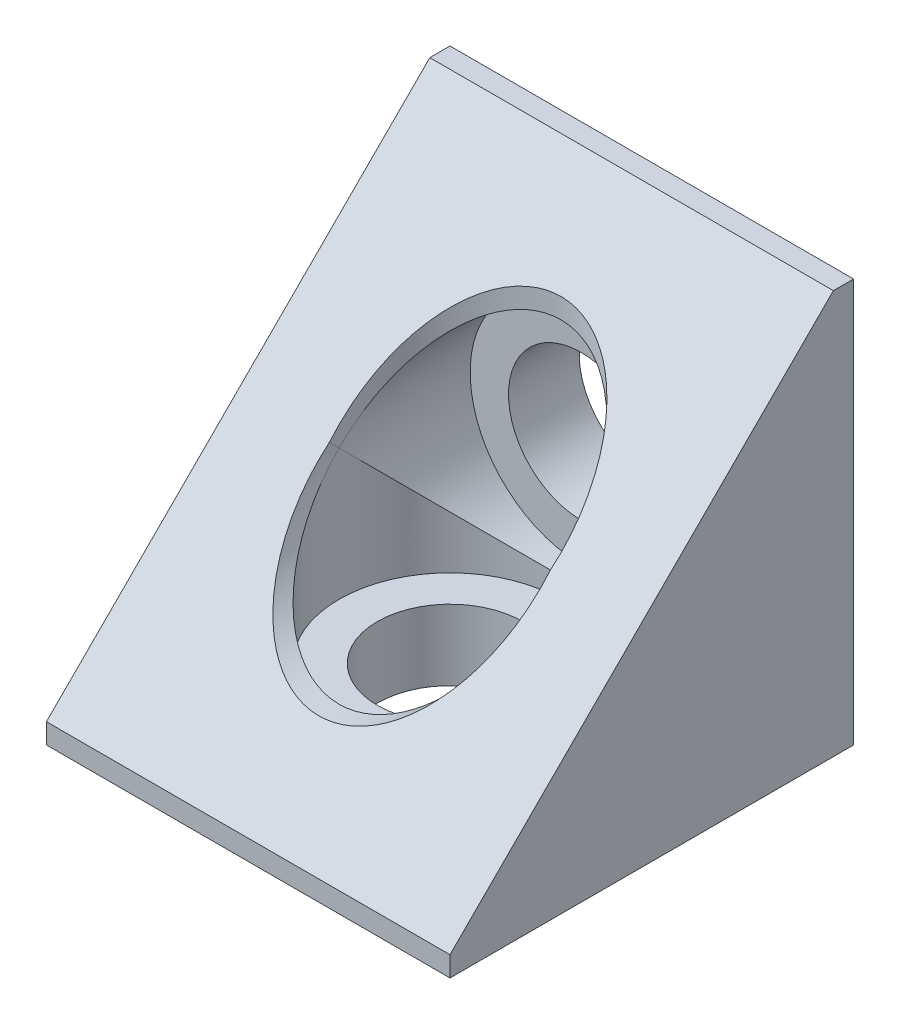
ISO-10303-21;
HEADER;
FILE_DESCRIPTION(('STEP AP214'),'2;1');
FILE_NAME('part.step','',(''),(''),'','','');
FILE_SCHEMA(('AUTOMOTIVE_DESIGN { 1 0 10303 214 1 1 1 1 }'));
ENDSEC;
DATA;
#1=APPLICATION_CONTEXT('core data for automotive mechanical design processes');
#2=APPLICATION_PROTOCOL_DEFINITION('international standard','automotive_design',2000,#1);
#3=PRODUCT_CONTEXT('',#1,'mechanical');
#4=PRODUCT('Part','Part','',(#3));
#5=PRODUCT_RELATED_PRODUCT_CATEGORY('part','',(#4));
#6=PRODUCT_DEFINITION_FORMATION('','',#4);
#7=PRODUCT_DEFINITION_CONTEXT('part definition',#1,'design');
#8=PRODUCT_DEFINITION('design','',#6,#7);
#9=PRODUCT_DEFINITION_SHAPE('','',#8);
#10=(LENGTH_UNIT() NAMED_UNIT(*) SI_UNIT(.MILLI.,.METRE.));
#11=(NAMED_UNIT(*) PLANE_ANGLE_UNIT() SI_UNIT($,.RADIAN.));
#12=(NAMED_UNIT(*) SI_UNIT($,.STERADIAN.) SOLID_ANGLE_UNIT());
#13=UNCERTAINTY_MEASURE_WITH_UNIT(LENGTH_MEASURE(1.E-05),#10,'distance_accuracy_value','');
#14=(GEOMETRIC_REPRESENTATION_CONTEXT(3) GLOBAL_UNCERTAINTY_ASSIGNED_CONTEXT((#13)) GLOBAL_UNIT_ASSIGNED_CONTEXT((#10,
#11,#12)) REPRESENTATION_CONTEXT('',''));
#15=CARTESIAN_POINT('',(0.,0.,0.));
#16=DIRECTION('',(0.,0.,1.));
#17=DIRECTION('',(1.,0.,0.));
#18=AXIS2_PLACEMENT_3D('',#15,#16,#17);
#19=CARTESIAN_POINT('',(0.,0.,-6.5));
#20=DIRECTION('',(0.,0.,1.));
#21=DIRECTION('',(1.,0.,0.));
#22=AXIS2_PLACEMENT_3D('',#19,#20,#21);
#23=CYLINDRICAL_SURFACE('',#22,5.5);
#24=CARTESIAN_POINT('',(0.,0.,0.));
#25=DIRECTION('',(0.,-0.707106781186547,0.707106781186547));
#26=DIRECTION('',(0.,0.707106781186547,0.707106781186547));
#27=AXIS2_PLACEMENT_3D('',#24,#25,#26);
#28=ELLIPSE('',#27,7.77817459305202,5.5);
#29=CARTESIAN_POINT('',(-5.5,0.,0.));
#30=VERTEX_POINT('',#29);
#31=CARTESIAN_POINT('',(-5.47722557505165,0.500000000000052,0.500000000000055));
#32=VERTEX_POINT('',#31);
#33=EDGE_CURVE('E147',#30,#32,#28,.F.);
#34=ORIENTED_EDGE('',*,*,#33,.T.);
#35=CARTESIAN_POINT('',(0.,0.,1.0000000000001));
#36=DIRECTION('',(0.,-0.707106781186544,-0.707106781186552));
#37=DIRECTION('',(0.,-0.707106781186552,0.707106781186544));
#38=AXIS2_PLACEMENT_3D('',#35,#36,#37);
#39=ELLIPSE('',#38,7.77817459305198,5.5);
#40=CARTESIAN_POINT('',(5.47722557505166,0.500000000000053,0.500000000000053));
#41=VERTEX_POINT('',#40);
#42=EDGE_CURVE('E56',#32,#41,#39,.F.);
#43=ORIENTED_EDGE('',*,*,#42,.T.);
#44=CARTESIAN_POINT('',(5.5,0.,0.));
#45=VERTEX_POINT('',#44);
#46=EDGE_CURVE('E137',#41,#45,#28,.F.);
#47=ORIENTED_EDGE('',*,*,#46,.T.);
#48=CARTESIAN_POINT('',(0.,0.,0.));
#49=DIRECTION('',(0.,0.707106781186547,0.707106781186547));
#50=DIRECTION('',(0.,-0.707106781186547,0.707106781186547));
#51=AXIS2_PLACEMENT_3D('',#48,#49,#50);
#52=ELLIPSE('',#51,7.77817459305202,5.5);
#53=EDGE_CURVE('E42',#45,#30,#52,.F.);
#54=ORIENTED_EDGE('',*,*,#53,.T.);
#55=EDGE_LOOP('',(#34,#43,#47,#54));
#56=FACE_BOUND('',#55,.T.);
#57=ADVANCED_FACE('F34',(#56),#23,.F.);
#58=CARTESIAN_POINT('',(0.,-10.,0.));
#59=DIRECTION('',(0.,1.,0.));
#60=DIRECTION('',(-1.,0.,0.));
#61=AXIS2_PLACEMENT_3D('',#58,#59,#60);
#62=CYLINDRICAL_SURFACE('',#61,3.6);
#63=CARTESIAN_POINT('',(0.,-10.,0.));
#64=DIRECTION('',(0.,1.,0.));
#65=DIRECTION('',(-1.,0.,0.));
#66=AXIS2_PLACEMENT_3D('',#63,#64,#65);
#67=CIRCLE('',#66,3.6);
#68=CARTESIAN_POINT('',(-3.6,-10.,0.));
#69=VERTEX_POINT('',#68);
#70=EDGE_CURVE('E145',#69,#69,#67,.T.);
#71=ORIENTED_EDGE('',*,*,#70,.F.);
#72=EDGE_LOOP('',(#71));
#73=FACE_BOUND('',#72,.T.);
#74=CARTESIAN_POINT('',(0.,-6.5,0.));
#75=DIRECTION('',(0.,1.,0.));
#76=DIRECTION('',(-1.,0.,0.));
#77=AXIS2_PLACEMENT_3D('',#74,#75,#76);
#78=CIRCLE('',#77,3.6);
#79=CARTESIAN_POINT('',(-3.6,-6.50000000000001,0.));
#80=VERTEX_POINT('',#79);
#81=EDGE_CURVE('E142',#80,#80,#78,.F.);
#82=ORIENTED_EDGE('',*,*,#81,.F.);
#83=EDGE_LOOP('',(#82));
#84=FACE_BOUND('',#83,.T.);
#85=ADVANCED_FACE('F192',(#73,#84),#62,.F.);
#86=CARTESIAN_POINT('',(0.,0.,10.));
#87=DIRECTION('',(0.,0.,-1.));
#88=DIRECTION('',(-1.,0.,0.));
#89=AXIS2_PLACEMENT_3D('',#86,#87,#88);
#90=CYLINDRICAL_SURFACE('',#89,3.6);
#91=CARTESIAN_POINT('',(0.,0.,-10.));
#92=DIRECTION('',(0.,0.,1.));
#93=DIRECTION('',(1.,0.,0.));
#94=AXIS2_PLACEMENT_3D('',#91,#92,#93);
#95=CIRCLE('',#94,3.6);
#96=CARTESIAN_POINT('',(3.6,0.,-10.));
#97=VERTEX_POINT('',#96);
#98=EDGE_CURVE('E119',#97,#97,#95,.T.);
#99=ORIENTED_EDGE('',*,*,#98,.F.);
#100=EDGE_LOOP('',(#99));
#101=FACE_BOUND('',#100,.T.);
#102=CARTESIAN_POINT('',(0.,0.,-6.5));
#103=DIRECTION('',(0.,0.,1.));
#104=DIRECTION('',(1.,0.,0.));
#105=AXIS2_PLACEMENT_3D('',#102,#103,#104);
#106=CIRCLE('',#105,3.6);
#107=CARTESIAN_POINT('',(3.6,0.,-6.5));
#108=VERTEX_POINT('',#107);
#109=EDGE_CURVE('E138',#108,#108,#106,.T.);
#110=ORIENTED_EDGE('',*,*,#109,.T.);
#111=EDGE_LOOP('',(#110));
#112=FACE_BOUND('',#111,.T.);
#113=ADVANCED_FACE('F196',(#101,#112),#90,.F.);
#114=CARTESIAN_POINT('',(0.,0.,10.));
#115=DIRECTION('',(0.,0.,1.));
#116=DIRECTION('',(1.,0.,0.));
#117=AXIS2_PLACEMENT_3D('',#114,#115,#116);
#118=PLANE('',#117);
#119=DIRECTION('',(1.,0.,0.));
#120=VECTOR('',#119,1.);
#121=CARTESIAN_POINT('',(-9.99999999999999,-9.,10.));
#122=LINE('',#121,#120);
#123=CARTESIAN_POINT('',(-9.99999999999999,-9.,10.));
#124=VERTEX_POINT('',#123);
#125=CARTESIAN_POINT('',(10.,-9.,10.));
#126=VERTEX_POINT('',#125);
#127=EDGE_CURVE('E93',#124,#126,#122,.T.);
#128=ORIENTED_EDGE('',*,*,#127,.F.);
#129=DIRECTION('',(0.,-1.,0.));
#130=VECTOR('',#129,1.);
#131=CARTESIAN_POINT('',(-10.,-10.,10.));
#132=LINE('',#131,#130);
#133=CARTESIAN_POINT('',(-10.,-10.,10.));
#134=VERTEX_POINT('',#133);
#135=EDGE_CURVE('E102',#124,#134,#132,.T.);
#136=ORIENTED_EDGE('',*,*,#135,.T.);
#137=DIRECTION('',(1.,0.,0.));
#138=VECTOR('',#137,1.);
#139=CARTESIAN_POINT('',(10.,-10.,10.));
#140=LINE('',#139,#138);
#141=CARTESIAN_POINT('',(10.,-10.,10.));
#142=VERTEX_POINT('',#141);
#143=EDGE_CURVE('E111',#134,#142,#140,.T.);
#144=ORIENTED_EDGE('',*,*,#143,.T.);
#145=DIRECTION('',(0.,1.,0.));
#146=VECTOR('',#145,1.);
#147=CARTESIAN_POINT('',(10.,-10.,10.));
#148=LINE('',#147,#146);
#149=EDGE_CURVE('E105',#142,#126,#148,.T.);
#150=ORIENTED_EDGE('',*,*,#149,.T.);
#151=EDGE_LOOP('',(#128,#136,#144,#150));
#152=FACE_BOUND('',#151,.T.);
#153=ADVANCED_FACE('F101',(#152),#118,.T.);
#154=CARTESIAN_POINT('',(0.,0.,-10.));
#155=DIRECTION('',(0.,0.,1.));
#156=DIRECTION('',(1.,0.,0.));
#157=AXIS2_PLACEMENT_3D('',#154,#155,#156);
#158=PLANE('',#157);
#159=DIRECTION('',(0.,-1.,0.));
#160=VECTOR('',#159,1.);
#161=CARTESIAN_POINT('',(-10.,-10.,-10.));
#162=LINE('',#161,#160);
#163=CARTESIAN_POINT('',(-10.,9.99999999999999,-10.));
#164=VERTEX_POINT('',#163);
#165=CARTESIAN_POINT('',(-10.,-10.,-10.));
#166=VERTEX_POINT('',#165);
#167=EDGE_CURVE('E124',#164,#166,#162,.T.);
#168=ORIENTED_EDGE('',*,*,#167,.F.);
#169=DIRECTION('',(-1.,0.,0.));
#170=VECTOR('',#169,1.);
#171=CARTESIAN_POINT('',(10.,10.,-10.));
#172=LINE('',#171,#170);
#173=CARTESIAN_POINT('',(10.,10.,-10.));
#174=VERTEX_POINT('',#173);
#175=EDGE_CURVE('E112',#174,#164,#172,.T.);
#176=ORIENTED_EDGE('',*,*,#175,.F.);
#177=DIRECTION('',(0.,1.,0.));
#178=VECTOR('',#177,1.);
#179=CARTESIAN_POINT('',(10.,-10.,-10.));
#180=LINE('',#179,#178);
#181=CARTESIAN_POINT('',(10.,-10.,-10.));
#182=VERTEX_POINT('',#181);
#183=EDGE_CURVE('E116',#182,#174,#180,.T.);
#184=ORIENTED_EDGE('',*,*,#183,.F.);
#185=DIRECTION('',(1.,0.,0.));
#186=VECTOR('',#185,1.);
#187=CARTESIAN_POINT('',(10.,-10.,-10.));
#188=LINE('',#187,#186);
#189=EDGE_CURVE('E126',#166,#182,#188,.T.);
#190=ORIENTED_EDGE('',*,*,#189,.F.);
#191=EDGE_LOOP('',(#168,#176,#184,#190));
#192=FACE_BOUND('',#191,.T.);
#193=ORIENTED_EDGE('',*,*,#98,.T.);
#194=EDGE_LOOP('',(#193));
#195=FACE_BOUND('',#194,.T.);
#196=ADVANCED_FACE('F278',(#192,#195),#158,.F.);
#197=CARTESIAN_POINT('',(-10.,-10.,10.));
#198=DIRECTION('',(1.,0.,0.));
#199=DIRECTION('',(0.,0.,-1.));
#200=AXIS2_PLACEMENT_3D('',#197,#198,#199);
#201=PLANE('',#200);
#202=ORIENTED_EDGE('',*,*,#135,.F.);
#203=DIRECTION('',(0.,0.707106781186552,-0.707106781186544));
#204=VECTOR('',#203,1.);
#205=CARTESIAN_POINT('',(-9.99999999999999,-9.,10.));
#206=LINE('',#205,#204);
#207=CARTESIAN_POINT('',(-9.99999999999999,10.,-8.99999999999979));
#208=VERTEX_POINT('',#207);
#209=EDGE_CURVE('E90',#124,#208,#206,.T.);
#210=ORIENTED_EDGE('',*,*,#209,.T.);
#211=DIRECTION('',(0.,0.,-1.));
#212=VECTOR('',#211,1.);
#213=CARTESIAN_POINT('',(-10.,9.99999999999999,10.));
#214=LINE('',#213,#212);
#215=EDGE_CURVE('E123',#208,#164,#214,.T.);
#216=ORIENTED_EDGE('',*,*,#215,.T.);
#217=ORIENTED_EDGE('',*,*,#167,.T.);
#218=DIRECTION('',(0.,0.,-1.));
#219=VECTOR('',#218,1.);
#220=CARTESIAN_POINT('',(-10.,-10.,10.));
#221=LINE('',#220,#219);
#222=EDGE_CURVE('E110',#134,#166,#221,.T.);
#223=ORIENTED_EDGE('',*,*,#222,.F.);
#224=EDGE_LOOP('',(#202,#210,#216,#217,#223));
#225=FACE_BOUND('',#224,.T.);
#226=ADVANCED_FACE('F36',(#225),#201,.F.);
#227=CARTESIAN_POINT('',(10.,-10.,10.));
#228=DIRECTION('',(0.,1.,0.));
#229=DIRECTION('',(-1.,0.,0.));
#230=AXIS2_PLACEMENT_3D('',#227,#228,#229);
#231=PLANE('',#230);
#232=ORIENTED_EDGE('',*,*,#70,.T.);
#233=EDGE_LOOP('',(#232));
#234=FACE_BOUND('',#233,.T.);
#235=ORIENTED_EDGE('',*,*,#189,.T.);
#236=DIRECTION('',(0.,0.,-1.));
#237=VECTOR('',#236,1.);
#238=CARTESIAN_POINT('',(10.,-10.,10.));
#239=LINE('',#238,#237);
#240=EDGE_CURVE('E133',#142,#182,#239,.T.);
#241=ORIENTED_EDGE('',*,*,#240,.F.);
#242=ORIENTED_EDGE('',*,*,#143,.F.);
#243=ORIENTED_EDGE('',*,*,#222,.T.);
#244=EDGE_LOOP('',(#235,#241,#242,#243));
#245=FACE_BOUND('',#244,.T.);
#246=ADVANCED_FACE('F243',(#234,#245),#231,.F.);
#247=CARTESIAN_POINT('',(10.,-10.,10.));
#248=DIRECTION('',(-1.,0.,0.));
#249=DIRECTION('',(0.,0.,1.));
#250=AXIS2_PLACEMENT_3D('',#247,#248,#249);
#251=PLANE('',#250);
#252=DIRECTION('',(0.,0.,-1.));
#253=VECTOR('',#252,1.);
#254=CARTESIAN_POINT('',(10.,10.,10.));
#255=LINE('',#254,#253);
#256=CARTESIAN_POINT('',(10.,10.,-8.99999999999979));
#257=VERTEX_POINT('',#256);
#258=EDGE_CURVE('E131',#257,#174,#255,.T.);
#259=ORIENTED_EDGE('',*,*,#258,.F.);
#260=DIRECTION('',(0.,0.707106781186552,-0.707106781186544));
#261=VECTOR('',#260,1.);
#262=CARTESIAN_POINT('',(10.,-9.,10.));
#263=LINE('',#262,#261);
#264=EDGE_CURVE('E49',#126,#257,#263,.T.);
#265=ORIENTED_EDGE('',*,*,#264,.F.);
#266=ORIENTED_EDGE('',*,*,#149,.F.);
#267=ORIENTED_EDGE('',*,*,#240,.T.);
#268=ORIENTED_EDGE('',*,*,#183,.T.);
#269=EDGE_LOOP('',(#259,#265,#266,#267,#268));
#270=FACE_BOUND('',#269,.T.);
#271=ADVANCED_FACE('F187',(#270),#251,.F.);
#272=CARTESIAN_POINT('',(10.,10.,10.));
#273=DIRECTION('',(0.,-1.,0.));
#274=DIRECTION('',(1.,0.,0.));
#275=AXIS2_PLACEMENT_3D('',#272,#273,#274);
#276=PLANE('',#275);
#277=ORIENTED_EDGE('',*,*,#215,.F.);
#278=DIRECTION('',(1.,0.,0.));
#279=VECTOR('',#278,1.);
#280=CARTESIAN_POINT('',(-9.99999999999999,10.,-8.99999999999979));
#281=LINE('',#280,#279);
#282=EDGE_CURVE('E94',#208,#257,#281,.T.);
#283=ORIENTED_EDGE('',*,*,#282,.T.);
#284=ORIENTED_EDGE('',*,*,#258,.T.);
#285=ORIENTED_EDGE('',*,*,#175,.T.);
#286=EDGE_LOOP('',(#277,#283,#284,#285));
#287=FACE_BOUND('',#286,.T.);
#288=ADVANCED_FACE('F178',(#287),#276,.F.);
#289=CARTESIAN_POINT('',(0.,0.,0.));
#290=DIRECTION('',(0.,-0.707106781186547,0.707106781186547));
#291=DIRECTION('',(0.,0.707106781186547,0.707106781186547));
#292=AXIS2_PLACEMENT_3D('',#289,#290,#291);
#293=ELLIPSE('',#292,7.77817459305202,5.5);
#294=EDGE_CURVE('E150',#30,#45,#293,.T.);
#295=ORIENTED_EDGE('',*,*,#294,.T.);
#296=CARTESIAN_POINT('',(0.,0.,0.));
#297=DIRECTION('',(0.,0.707106781186547,0.707106781186547));
#298=DIRECTION('',(0.,-0.707106781186547,0.707106781186547));
#299=AXIS2_PLACEMENT_3D('',#296,#297,#298);
#300=ELLIPSE('',#299,7.77817459305202,5.5);
#301=EDGE_CURVE('E153',#45,#30,#300,.T.);
#302=ORIENTED_EDGE('',*,*,#301,.T.);
#303=EDGE_LOOP('',(#295,#302));
#304=FACE_BOUND('',#303,.T.);
#305=CARTESIAN_POINT('',(0.,0.,-6.5));
#306=DIRECTION('',(0.,0.,1.));
#307=DIRECTION('',(1.,0.,0.));
#308=AXIS2_PLACEMENT_3D('',#305,#306,#307);
#309=CIRCLE('',#308,5.5);
#310=CARTESIAN_POINT('',(5.5,0.,-6.5));
#311=VERTEX_POINT('',#310);
#312=EDGE_CURVE('E141',#311,#311,#309,.T.);
#313=ORIENTED_EDGE('',*,*,#312,.F.);
#314=EDGE_LOOP('',(#313));
#315=FACE_BOUND('',#314,.T.);
#316=ADVANCED_FACE('F163',(#304,#315),#23,.F.);
#317=CARTESIAN_POINT('',(0.,0.,-6.5));
#318=DIRECTION('',(0.,0.,1.));
#319=DIRECTION('',(1.,0.,0.));
#320=AXIS2_PLACEMENT_3D('',#317,#318,#319);
#321=PLANE('',#320);
#322=ORIENTED_EDGE('',*,*,#109,.F.);
#323=EDGE_LOOP('',(#322));
#324=FACE_BOUND('',#323,.T.);
#325=ORIENTED_EDGE('',*,*,#312,.T.);
#326=EDGE_LOOP('',(#325));
#327=FACE_BOUND('',#326,.T.);
#328=ADVANCED_FACE('F176',(#324,#327),#321,.T.);
#329=CARTESIAN_POINT('',(0.,-6.5,0.));
#330=DIRECTION('',(0.,1.,0.));
#331=DIRECTION('',(-1.,0.,0.));
#332=AXIS2_PLACEMENT_3D('',#329,#330,#331);
#333=PLANE('',#332);
#334=CARTESIAN_POINT('',(0.,-6.5,0.));
#335=DIRECTION('',(0.,1.,0.));
#336=DIRECTION('',(-1.,0.,0.));
#337=AXIS2_PLACEMENT_3D('',#334,#335,#336);
#338=CIRCLE('',#337,5.5);
#339=CARTESIAN_POINT('',(-5.5,-6.50000000000001,0.));
#340=VERTEX_POINT('',#339);
#341=EDGE_CURVE('E146',#340,#340,#338,.T.);
#342=ORIENTED_EDGE('',*,*,#341,.T.);
#343=EDGE_LOOP('',(#342));
#344=FACE_BOUND('',#343,.T.);
#345=ORIENTED_EDGE('',*,*,#81,.T.);
#346=EDGE_LOOP('',(#345));
#347=FACE_BOUND('',#346,.T.);
#348=ADVANCED_FACE('F184',(#344,#347),#333,.T.);
#349=CARTESIAN_POINT('',(0.,-6.5,0.));
#350=DIRECTION('',(0.,1.,0.));
#351=DIRECTION('',(-1.,0.,0.));
#352=AXIS2_PLACEMENT_3D('',#349,#350,#351);
#353=CYLINDRICAL_SURFACE('',#352,5.5);
#354=ORIENTED_EDGE('',*,*,#341,.F.);
#355=EDGE_LOOP('',(#354));
#356=FACE_BOUND('',#355,.T.);
#357=ORIENTED_EDGE('',*,*,#294,.F.);
#358=ORIENTED_EDGE('',*,*,#53,.F.);
#359=EDGE_LOOP('',(#357,#358));
#360=FACE_BOUND('',#359,.T.);
#361=ADVANCED_FACE('F206',(#356,#360),#353,.F.);
#362=ORIENTED_EDGE('',*,*,#46,.F.);
#363=CARTESIAN_POINT('',(0.,1.00000000000011,0.));
#364=DIRECTION('',(0.,-0.707106781186544,-0.707106781186552));
#365=DIRECTION('',(0.,0.707106781186552,-0.707106781186544));
#366=AXIS2_PLACEMENT_3D('',#363,#364,#365);
#367=ELLIPSE('',#366,7.77817459305207,5.5);
#368=EDGE_CURVE('E11',#41,#32,#367,.F.);
#369=ORIENTED_EDGE('',*,*,#368,.T.);
#370=ORIENTED_EDGE('',*,*,#33,.F.);
#371=ORIENTED_EDGE('',*,*,#301,.F.);
#372=EDGE_LOOP('',(#362,#369,#370,#371));
#373=FACE_BOUND('',#372,.T.);
#374=ADVANCED_FACE('F166',(#373),#353,.F.);
#375=CARTESIAN_POINT('',(-9.99999999999999,-9.,10.));
#376=DIRECTION('',(0.,-0.707106781186544,-0.707106781186552));
#377=DIRECTION('',(0.,0.707106781186552,-0.707106781186544));
#378=AXIS2_PLACEMENT_3D('',#375,#376,#377);
#379=PLANE('',#378);
#380=ORIENTED_EDGE('',*,*,#264,.T.);
#381=ORIENTED_EDGE('',*,*,#282,.F.);
#382=ORIENTED_EDGE('',*,*,#209,.F.);
#383=ORIENTED_EDGE('',*,*,#127,.T.);
#384=EDGE_LOOP('',(#380,#381,#382,#383));
#385=FACE_BOUND('',#384,.T.);
#386=ORIENTED_EDGE('',*,*,#368,.F.);
#387=ORIENTED_EDGE('',*,*,#42,.F.);
#388=EDGE_LOOP('',(#386,#387));
#389=FACE_BOUND('',#388,.T.);
#390=ADVANCED_FACE('F92',(#385,#389),#379,.F.);
#391=CLOSED_SHELL('',(#57,#85,#113,#153,#196,#226,#246,#271,#288,#316,#328,#348,#361,#374,#390));
#392=MANIFOLD_SOLID_BREP('B2',#391);
#393=ADVANCED_BREP_SHAPE_REPRESENTATION('',(#18,#392),#14);
#394=SHAPE_DEFINITION_REPRESENTATION(#9,#393);
ENDSEC;
END-ISO-10303-21;
